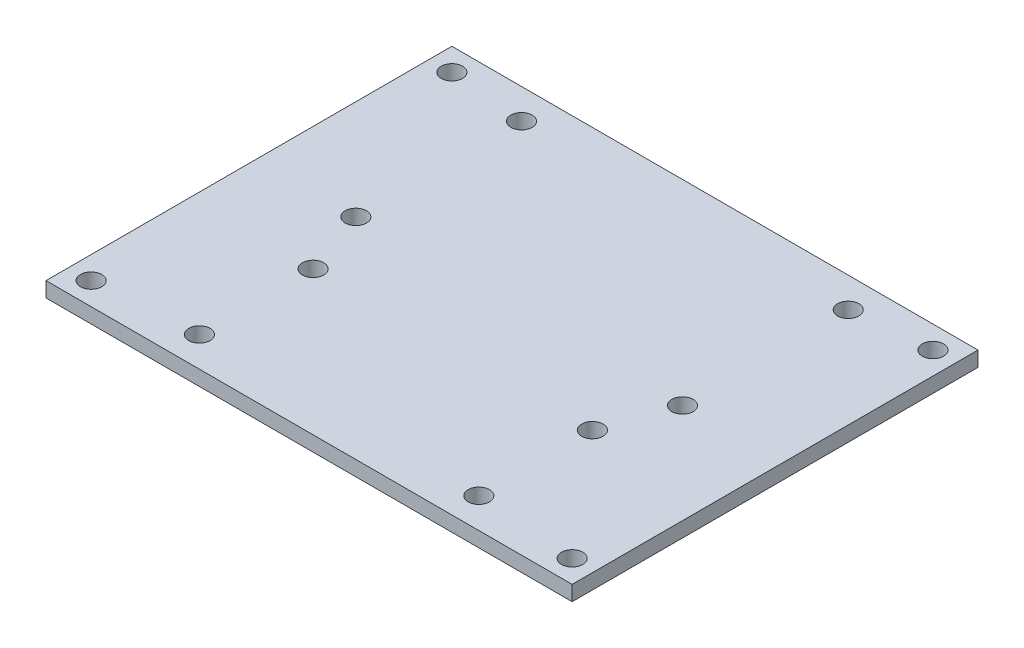
ISO-10303-21;
HEADER;
FILE_DESCRIPTION(('STEP AP214'),'2;1');
FILE_NAME('part.step','',(''),(''),'','','');
FILE_SCHEMA(('AUTOMOTIVE_DESIGN { 1 0 10303 214 1 1 1 1 }'));
ENDSEC;
DATA;
#1=APPLICATION_CONTEXT('core data for automotive mechanical design processes');
#2=APPLICATION_PROTOCOL_DEFINITION('international standard','automotive_design',2000,#1);
#3=PRODUCT_CONTEXT('',#1,'mechanical');
#4=PRODUCT('Part','Part','',(#3));
#5=PRODUCT_RELATED_PRODUCT_CATEGORY('part','',(#4));
#6=PRODUCT_DEFINITION_FORMATION('','',#4);
#7=PRODUCT_DEFINITION_CONTEXT('part definition',#1,'design');
#8=PRODUCT_DEFINITION('design','',#6,#7);
#9=PRODUCT_DEFINITION_SHAPE('','',#8);
#10=(LENGTH_UNIT() NAMED_UNIT(*) SI_UNIT(.MILLI.,.METRE.));
#11=(NAMED_UNIT(*) PLANE_ANGLE_UNIT() SI_UNIT($,.RADIAN.));
#12=(NAMED_UNIT(*) SI_UNIT($,.STERADIAN.) SOLID_ANGLE_UNIT());
#13=UNCERTAINTY_MEASURE_WITH_UNIT(LENGTH_MEASURE(1.E-05),#10,'distance_accuracy_value','');
#14=(GEOMETRIC_REPRESENTATION_CONTEXT(3) GLOBAL_UNCERTAINTY_ASSIGNED_CONTEXT((#13)) GLOBAL_UNIT_ASSIGNED_CONTEXT((#10,
#11,#12)) REPRESENTATION_CONTEXT('',''));
#15=CARTESIAN_POINT('',(0.,0.,0.));
#16=DIRECTION('',(0.,0.,1.));
#17=DIRECTION('',(1.,0.,0.));
#18=AXIS2_PLACEMENT_3D('',#15,#16,#17);
#19=CARTESIAN_POINT('',(0.,0.,0.));
#20=DIRECTION('',(0.,-1.,0.));
#21=DIRECTION('',(0.,0.,-1.));
#22=AXIS2_PLACEMENT_3D('',#19,#20,#21);
#23=PLANE('',#22);
#24=DIRECTION('',(0.,0.,1.));
#25=VECTOR('',#24,1.);
#26=CARTESIAN_POINT('',(-55.5625,0.,42.8625));
#27=LINE('',#26,#25);
#28=CARTESIAN_POINT('',(-55.5625,0.,-42.8625));
#29=VERTEX_POINT('',#28);
#30=CARTESIAN_POINT('',(-55.5625,0.,42.8625));
#31=VERTEX_POINT('',#30);
#32=EDGE_CURVE('E101',#29,#31,#27,.T.);
#33=ORIENTED_EDGE('',*,*,#32,.F.);
#34=DIRECTION('',(-1.,0.,0.));
#35=VECTOR('',#34,1.);
#36=CARTESIAN_POINT('',(-55.5625,0.,-42.8625));
#37=LINE('',#36,#35);
#38=CARTESIAN_POINT('',(55.5625,0.,-42.8625));
#39=VERTEX_POINT('',#38);
#40=EDGE_CURVE('E77',#39,#29,#37,.T.);
#41=ORIENTED_EDGE('',*,*,#40,.F.);
#42=DIRECTION('',(0.,0.,-1.));
#43=VECTOR('',#42,1.);
#44=CARTESIAN_POINT('',(55.5625,0.,42.8625));
#45=LINE('',#44,#43);
#46=CARTESIAN_POINT('',(55.5625,0.,42.8625));
#47=VERTEX_POINT('',#46);
#48=EDGE_CURVE('E71',#47,#39,#45,.T.);
#49=ORIENTED_EDGE('',*,*,#48,.F.);
#50=DIRECTION('',(1.,0.,0.));
#51=VECTOR('',#50,1.);
#52=CARTESIAN_POINT('',(-55.5625,0.,42.8625));
#53=LINE('',#52,#51);
#54=EDGE_CURVE('E93',#31,#47,#53,.T.);
#55=ORIENTED_EDGE('',*,*,#54,.F.);
#56=EDGE_LOOP('',(#33,#41,#49,#55));
#57=FACE_BOUND('',#56,.T.);
#58=CARTESIAN_POINT('',(50.8,0.,-38.1));
#59=DIRECTION('',(0.,-1.,0.));
#60=DIRECTION('',(0.,0.,-1.));
#61=AXIS2_PLACEMENT_3D('',#58,#59,#60);
#62=CIRCLE('',#61,2.25);
#63=CARTESIAN_POINT('',(50.8,0.,-40.35));
#64=VERTEX_POINT('',#63);
#65=EDGE_CURVE('E117',#64,#64,#62,.T.);
#66=ORIENTED_EDGE('',*,*,#65,.F.);
#67=EDGE_LOOP('',(#66));
#68=FACE_BOUND('',#67,.T.);
#69=CARTESIAN_POINT('',(-50.8,0.,-38.1));
#70=DIRECTION('',(0.,-1.,0.));
#71=DIRECTION('',(0.,0.,-1.));
#72=AXIS2_PLACEMENT_3D('',#69,#70,#71);
#73=CIRCLE('',#72,2.25);
#74=CARTESIAN_POINT('',(-50.8,0.,-40.35));
#75=VERTEX_POINT('',#74);
#76=EDGE_CURVE('E123',#75,#75,#73,.T.);
#77=ORIENTED_EDGE('',*,*,#76,.F.);
#78=EDGE_LOOP('',(#77));
#79=FACE_BOUND('',#78,.T.);
#80=CARTESIAN_POINT('',(50.8,0.,38.1));
#81=DIRECTION('',(0.,-1.,0.));
#82=DIRECTION('',(0.,0.,-1.));
#83=AXIS2_PLACEMENT_3D('',#80,#81,#82);
#84=CIRCLE('',#83,2.25);
#85=CARTESIAN_POINT('',(50.8,0.,35.85));
#86=VERTEX_POINT('',#85);
#87=EDGE_CURVE('E129',#86,#86,#84,.T.);
#88=ORIENTED_EDGE('',*,*,#87,.F.);
#89=EDGE_LOOP('',(#88));
#90=FACE_BOUND('',#89,.T.);
#91=CARTESIAN_POINT('',(-50.8,0.,38.1));
#92=DIRECTION('',(0.,-1.,0.));
#93=DIRECTION('',(0.,0.,-1.));
#94=AXIS2_PLACEMENT_3D('',#91,#92,#93);
#95=CIRCLE('',#94,2.25);
#96=CARTESIAN_POINT('',(-50.8,0.,35.85));
#97=VERTEX_POINT('',#96);
#98=EDGE_CURVE('E135',#97,#97,#95,.T.);
#99=ORIENTED_EDGE('',*,*,#98,.F.);
#100=EDGE_LOOP('',(#99));
#101=FACE_BOUND('',#100,.T.);
#102=CARTESIAN_POINT('',(-34.5,0.,-1.51249999999999));
#103=DIRECTION('',(0.,1.,0.));
#104=DIRECTION('',(0.,0.,1.));
#105=AXIS2_PLACEMENT_3D('',#102,#103,#104);
#106=CIRCLE('',#105,2.25);
#107=CARTESIAN_POINT('',(-34.5,0.,0.737500000000009));
#108=VERTEX_POINT('',#107);
#109=EDGE_CURVE('E138',#108,#108,#106,.T.);
#110=ORIENTED_EDGE('',*,*,#109,.T.);
#111=EDGE_LOOP('',(#110));
#112=FACE_BOUND('',#111,.T.);
#113=CARTESIAN_POINT('',(-34.5,0.,-36.5125));
#114=DIRECTION('',(0.,1.,0.));
#115=DIRECTION('',(0.,0.,1.));
#116=AXIS2_PLACEMENT_3D('',#113,#114,#115);
#117=CIRCLE('',#116,2.25);
#118=CARTESIAN_POINT('',(-34.5,0.,-34.2625));
#119=VERTEX_POINT('',#118);
#120=EDGE_CURVE('E144',#119,#119,#117,.T.);
#121=ORIENTED_EDGE('',*,*,#120,.T.);
#122=EDGE_LOOP('',(#121));
#123=FACE_BOUND('',#122,.T.);
#124=CARTESIAN_POINT('',(34.5,0.,-36.5125));
#125=DIRECTION('',(0.,1.,0.));
#126=DIRECTION('',(0.,0.,1.));
#127=AXIS2_PLACEMENT_3D('',#124,#125,#126);
#128=CIRCLE('',#127,2.25);
#129=CARTESIAN_POINT('',(34.5,0.,-34.2625));
#130=VERTEX_POINT('',#129);
#131=EDGE_CURVE('E150',#130,#130,#128,.T.);
#132=ORIENTED_EDGE('',*,*,#131,.T.);
#133=EDGE_LOOP('',(#132));
#134=FACE_BOUND('',#133,.T.);
#135=CARTESIAN_POINT('',(34.5,0.,-1.51249999999999));
#136=DIRECTION('',(0.,1.,0.));
#137=DIRECTION('',(0.,0.,1.));
#138=AXIS2_PLACEMENT_3D('',#135,#136,#137);
#139=CIRCLE('',#138,2.25);
#140=CARTESIAN_POINT('',(34.5,0.,0.737500000000009));
#141=VERTEX_POINT('',#140);
#142=EDGE_CURVE('E156',#141,#141,#139,.T.);
#143=ORIENTED_EDGE('',*,*,#142,.T.);
#144=EDGE_LOOP('',(#143));
#145=FACE_BOUND('',#144,.T.);
#146=CARTESIAN_POINT('',(29.5,0.,36.5125));
#147=DIRECTION('',(0.,1.,0.));
#148=DIRECTION('',(0.,0.,1.));
#149=AXIS2_PLACEMENT_3D('',#146,#147,#148);
#150=CIRCLE('',#149,2.25);
#151=CARTESIAN_POINT('',(29.5,0.,38.7625));
#152=VERTEX_POINT('',#151);
#153=EDGE_CURVE('E162',#152,#152,#150,.T.);
#154=ORIENTED_EDGE('',*,*,#153,.T.);
#155=EDGE_LOOP('',(#154));
#156=FACE_BOUND('',#155,.T.);
#157=CARTESIAN_POINT('',(29.5,0.,12.5125));
#158=DIRECTION('',(0.,1.,0.));
#159=DIRECTION('',(0.,0.,1.));
#160=AXIS2_PLACEMENT_3D('',#157,#158,#159);
#161=CIRCLE('',#160,2.25);
#162=CARTESIAN_POINT('',(29.5,0.,14.7625));
#163=VERTEX_POINT('',#162);
#164=EDGE_CURVE('E168',#163,#163,#161,.T.);
#165=ORIENTED_EDGE('',*,*,#164,.T.);
#166=EDGE_LOOP('',(#165));
#167=FACE_BOUND('',#166,.T.);
#168=CARTESIAN_POINT('',(-29.5,0.,12.5125));
#169=DIRECTION('',(0.,1.,0.));
#170=DIRECTION('',(0.,0.,1.));
#171=AXIS2_PLACEMENT_3D('',#168,#169,#170);
#172=CIRCLE('',#171,2.25);
#173=CARTESIAN_POINT('',(-29.5,0.,14.7625));
#174=VERTEX_POINT('',#173);
#175=EDGE_CURVE('E174',#174,#174,#172,.T.);
#176=ORIENTED_EDGE('',*,*,#175,.T.);
#177=EDGE_LOOP('',(#176));
#178=FACE_BOUND('',#177,.T.);
#179=CARTESIAN_POINT('',(-29.5,0.,36.5125));
#180=DIRECTION('',(0.,1.,0.));
#181=DIRECTION('',(0.,0.,1.));
#182=AXIS2_PLACEMENT_3D('',#179,#180,#181);
#183=CIRCLE('',#182,2.25);
#184=CARTESIAN_POINT('',(-29.5,0.,38.7625));
#185=VERTEX_POINT('',#184);
#186=EDGE_CURVE('E180',#185,#185,#183,.T.);
#187=ORIENTED_EDGE('',*,*,#186,.T.);
#188=EDGE_LOOP('',(#187));
#189=FACE_BOUND('',#188,.T.);
#190=ADVANCED_FACE('F37',(#57,#68,#79,#90,#101,#112,#123,#134,#145,#156,#167,#178,#189),#23,.T.);
#191=CARTESIAN_POINT('',(-55.5625,3.175,42.8625));
#192=DIRECTION('',(1.,0.,0.));
#193=DIRECTION('',(0.,0.,-1.));
#194=AXIS2_PLACEMENT_3D('',#191,#192,#193);
#195=PLANE('',#194);
#196=ORIENTED_EDGE('',*,*,#32,.T.);
#197=DIRECTION('',(0.,-1.,0.));
#198=VECTOR('',#197,1.);
#199=CARTESIAN_POINT('',(-55.5625,3.175,42.8625));
#200=LINE('',#199,#198);
#201=CARTESIAN_POINT('',(-55.5625,3.175,42.8625));
#202=VERTEX_POINT('',#201);
#203=EDGE_CURVE('E11',#202,#31,#200,.T.);
#204=ORIENTED_EDGE('',*,*,#203,.F.);
#205=DIRECTION('',(0.,0.,1.));
#206=VECTOR('',#205,1.);
#207=CARTESIAN_POINT('',(-55.5625,3.175,42.8625));
#208=LINE('',#207,#206);
#209=CARTESIAN_POINT('',(-55.5625,3.175,-42.8625));
#210=VERTEX_POINT('',#209);
#211=EDGE_CURVE('E89',#210,#202,#208,.T.);
#212=ORIENTED_EDGE('',*,*,#211,.F.);
#213=DIRECTION('',(0.,-1.,0.));
#214=VECTOR('',#213,1.);
#215=CARTESIAN_POINT('',(-55.5625,3.175,-42.8625));
#216=LINE('',#215,#214);
#217=EDGE_CURVE('E97',#210,#29,#216,.T.);
#218=ORIENTED_EDGE('',*,*,#217,.T.);
#219=EDGE_LOOP('',(#196,#204,#212,#218));
#220=FACE_BOUND('',#219,.T.);
#221=ADVANCED_FACE('F39',(#220),#195,.F.);
#222=CARTESIAN_POINT('',(-55.5625,3.175,42.8625));
#223=DIRECTION('',(0.,0.,-1.));
#224=DIRECTION('',(-1.,0.,0.));
#225=AXIS2_PLACEMENT_3D('',#222,#223,#224);
#226=PLANE('',#225);
#227=ORIENTED_EDGE('',*,*,#54,.T.);
#228=DIRECTION('',(0.,-1.,0.));
#229=VECTOR('',#228,1.);
#230=CARTESIAN_POINT('',(55.5625,3.175,42.8625));
#231=LINE('',#230,#229);
#232=CARTESIAN_POINT('',(55.5625,3.175,42.8625));
#233=VERTEX_POINT('',#232);
#234=EDGE_CURVE('E46',#233,#47,#231,.T.);
#235=ORIENTED_EDGE('',*,*,#234,.F.);
#236=DIRECTION('',(1.,0.,0.));
#237=VECTOR('',#236,1.);
#238=CARTESIAN_POINT('',(-55.5625,3.175,42.8625));
#239=LINE('',#238,#237);
#240=EDGE_CURVE('E84',#202,#233,#239,.T.);
#241=ORIENTED_EDGE('',*,*,#240,.F.);
#242=ORIENTED_EDGE('',*,*,#203,.T.);
#243=EDGE_LOOP('',(#227,#235,#241,#242));
#244=FACE_BOUND('',#243,.T.);
#245=ADVANCED_FACE('F92',(#244),#226,.F.);
#246=CARTESIAN_POINT('',(55.5625,3.175,42.8625));
#247=DIRECTION('',(-1.,0.,0.));
#248=DIRECTION('',(0.,0.,1.));
#249=AXIS2_PLACEMENT_3D('',#246,#247,#248);
#250=PLANE('',#249);
#251=ORIENTED_EDGE('',*,*,#48,.T.);
#252=DIRECTION('',(0.,-1.,0.));
#253=VECTOR('',#252,1.);
#254=CARTESIAN_POINT('',(55.5625,3.175,-42.8625));
#255=LINE('',#254,#253);
#256=CARTESIAN_POINT('',(55.5625,3.175,-42.8625));
#257=VERTEX_POINT('',#256);
#258=EDGE_CURVE('E94',#257,#39,#255,.T.);
#259=ORIENTED_EDGE('',*,*,#258,.F.);
#260=DIRECTION('',(0.,0.,-1.));
#261=VECTOR('',#260,1.);
#262=CARTESIAN_POINT('',(55.5625,3.175,42.8625));
#263=LINE('',#262,#261);
#264=EDGE_CURVE('E87',#233,#257,#263,.T.);
#265=ORIENTED_EDGE('',*,*,#264,.F.);
#266=ORIENTED_EDGE('',*,*,#234,.T.);
#267=EDGE_LOOP('',(#251,#259,#265,#266));
#268=FACE_BOUND('',#267,.T.);
#269=ADVANCED_FACE('F95',(#268),#250,.F.);
#270=CARTESIAN_POINT('',(-55.5625,3.175,-42.8625));
#271=DIRECTION('',(0.,0.,1.));
#272=DIRECTION('',(1.,0.,0.));
#273=AXIS2_PLACEMENT_3D('',#270,#271,#272);
#274=PLANE('',#273);
#275=ORIENTED_EDGE('',*,*,#40,.T.);
#276=ORIENTED_EDGE('',*,*,#217,.F.);
#277=DIRECTION('',(-1.,0.,0.));
#278=VECTOR('',#277,1.);
#279=CARTESIAN_POINT('',(-55.5625,3.175,-42.8625));
#280=LINE('',#279,#278);
#281=EDGE_CURVE('E54',#257,#210,#280,.T.);
#282=ORIENTED_EDGE('',*,*,#281,.F.);
#283=ORIENTED_EDGE('',*,*,#258,.T.);
#284=EDGE_LOOP('',(#275,#276,#282,#283));
#285=FACE_BOUND('',#284,.T.);
#286=ADVANCED_FACE('F109',(#285),#274,.F.);
#287=CARTESIAN_POINT('',(0.,3.175,0.));
#288=DIRECTION('',(0.,-1.,0.));
#289=DIRECTION('',(0.,0.,-1.));
#290=AXIS2_PLACEMENT_3D('',#287,#288,#289);
#291=PLANE('',#290);
#292=CARTESIAN_POINT('',(-29.5,3.175,36.5125));
#293=DIRECTION('',(0.,1.,0.));
#294=DIRECTION('',(0.,0.,1.));
#295=AXIS2_PLACEMENT_3D('',#292,#293,#294);
#296=CIRCLE('',#295,2.25);
#297=CARTESIAN_POINT('',(-29.5,3.175,38.7625));
#298=VERTEX_POINT('',#297);
#299=EDGE_CURVE('E183',#298,#298,#296,.T.);
#300=ORIENTED_EDGE('',*,*,#299,.F.);
#301=EDGE_LOOP('',(#300));
#302=FACE_BOUND('',#301,.T.);
#303=CARTESIAN_POINT('',(-29.5,3.175,12.5125));
#304=DIRECTION('',(0.,1.,0.));
#305=DIRECTION('',(0.,0.,1.));
#306=AXIS2_PLACEMENT_3D('',#303,#304,#305);
#307=CIRCLE('',#306,2.25);
#308=CARTESIAN_POINT('',(-29.5,3.175,14.7625));
#309=VERTEX_POINT('',#308);
#310=EDGE_CURVE('E177',#309,#309,#307,.T.);
#311=ORIENTED_EDGE('',*,*,#310,.F.);
#312=EDGE_LOOP('',(#311));
#313=FACE_BOUND('',#312,.T.);
#314=CARTESIAN_POINT('',(29.5,3.175,12.5125));
#315=DIRECTION('',(0.,1.,0.));
#316=DIRECTION('',(0.,0.,1.));
#317=AXIS2_PLACEMENT_3D('',#314,#315,#316);
#318=CIRCLE('',#317,2.25);
#319=CARTESIAN_POINT('',(29.5,3.175,14.7625));
#320=VERTEX_POINT('',#319);
#321=EDGE_CURVE('E171',#320,#320,#318,.T.);
#322=ORIENTED_EDGE('',*,*,#321,.F.);
#323=EDGE_LOOP('',(#322));
#324=FACE_BOUND('',#323,.T.);
#325=CARTESIAN_POINT('',(29.5,3.175,36.5125));
#326=DIRECTION('',(0.,1.,0.));
#327=DIRECTION('',(0.,0.,1.));
#328=AXIS2_PLACEMENT_3D('',#325,#326,#327);
#329=CIRCLE('',#328,2.25);
#330=CARTESIAN_POINT('',(29.5,3.175,38.7625));
#331=VERTEX_POINT('',#330);
#332=EDGE_CURVE('E165',#331,#331,#329,.T.);
#333=ORIENTED_EDGE('',*,*,#332,.F.);
#334=EDGE_LOOP('',(#333));
#335=FACE_BOUND('',#334,.T.);
#336=CARTESIAN_POINT('',(34.5,3.175,-1.51249999999999));
#337=DIRECTION('',(0.,1.,0.));
#338=DIRECTION('',(0.,0.,1.));
#339=AXIS2_PLACEMENT_3D('',#336,#337,#338);
#340=CIRCLE('',#339,2.25);
#341=CARTESIAN_POINT('',(34.5,3.175,0.737500000000009));
#342=VERTEX_POINT('',#341);
#343=EDGE_CURVE('E159',#342,#342,#340,.T.);
#344=ORIENTED_EDGE('',*,*,#343,.F.);
#345=EDGE_LOOP('',(#344));
#346=FACE_BOUND('',#345,.T.);
#347=CARTESIAN_POINT('',(34.5,3.175,-36.5125));
#348=DIRECTION('',(0.,1.,0.));
#349=DIRECTION('',(0.,0.,1.));
#350=AXIS2_PLACEMENT_3D('',#347,#348,#349);
#351=CIRCLE('',#350,2.25);
#352=CARTESIAN_POINT('',(34.5,3.175,-34.2625));
#353=VERTEX_POINT('',#352);
#354=EDGE_CURVE('E153',#353,#353,#351,.T.);
#355=ORIENTED_EDGE('',*,*,#354,.F.);
#356=EDGE_LOOP('',(#355));
#357=FACE_BOUND('',#356,.T.);
#358=CARTESIAN_POINT('',(-34.5,3.175,-36.5125));
#359=DIRECTION('',(0.,1.,0.));
#360=DIRECTION('',(0.,0.,1.));
#361=AXIS2_PLACEMENT_3D('',#358,#359,#360);
#362=CIRCLE('',#361,2.25);
#363=CARTESIAN_POINT('',(-34.5,3.175,-34.2625));
#364=VERTEX_POINT('',#363);
#365=EDGE_CURVE('E147',#364,#364,#362,.T.);
#366=ORIENTED_EDGE('',*,*,#365,.F.);
#367=EDGE_LOOP('',(#366));
#368=FACE_BOUND('',#367,.T.);
#369=CARTESIAN_POINT('',(-34.5,3.175,-1.51249999999999));
#370=DIRECTION('',(0.,1.,0.));
#371=DIRECTION('',(0.,0.,1.));
#372=AXIS2_PLACEMENT_3D('',#369,#370,#371);
#373=CIRCLE('',#372,2.25);
#374=CARTESIAN_POINT('',(-34.5,3.175,0.737500000000009));
#375=VERTEX_POINT('',#374);
#376=EDGE_CURVE('E141',#375,#375,#373,.T.);
#377=ORIENTED_EDGE('',*,*,#376,.F.);
#378=EDGE_LOOP('',(#377));
#379=FACE_BOUND('',#378,.T.);
#380=CARTESIAN_POINT('',(-50.8,3.175,38.1));
#381=DIRECTION('',(0.,-1.,0.));
#382=DIRECTION('',(0.,0.,-1.));
#383=AXIS2_PLACEMENT_3D('',#380,#381,#382);
#384=CIRCLE('',#383,2.25);
#385=CARTESIAN_POINT('',(-50.8,3.175,35.85));
#386=VERTEX_POINT('',#385);
#387=EDGE_CURVE('E132',#386,#386,#384,.T.);
#388=ORIENTED_EDGE('',*,*,#387,.T.);
#389=EDGE_LOOP('',(#388));
#390=FACE_BOUND('',#389,.T.);
#391=CARTESIAN_POINT('',(50.8,3.175,38.1));
#392=DIRECTION('',(0.,-1.,0.));
#393=DIRECTION('',(0.,0.,-1.));
#394=AXIS2_PLACEMENT_3D('',#391,#392,#393);
#395=CIRCLE('',#394,2.25);
#396=CARTESIAN_POINT('',(50.8,3.175,35.85));
#397=VERTEX_POINT('',#396);
#398=EDGE_CURVE('E126',#397,#397,#395,.T.);
#399=ORIENTED_EDGE('',*,*,#398,.T.);
#400=EDGE_LOOP('',(#399));
#401=FACE_BOUND('',#400,.T.);
#402=CARTESIAN_POINT('',(-50.8,3.175,-38.1));
#403=DIRECTION('',(0.,-1.,0.));
#404=DIRECTION('',(0.,0.,-1.));
#405=AXIS2_PLACEMENT_3D('',#402,#403,#404);
#406=CIRCLE('',#405,2.25);
#407=CARTESIAN_POINT('',(-50.8,3.175,-40.35));
#408=VERTEX_POINT('',#407);
#409=EDGE_CURVE('E120',#408,#408,#406,.T.);
#410=ORIENTED_EDGE('',*,*,#409,.T.);
#411=EDGE_LOOP('',(#410));
#412=FACE_BOUND('',#411,.T.);
#413=CARTESIAN_POINT('',(50.8,3.175,-38.1));
#414=DIRECTION('',(0.,-1.,0.));
#415=DIRECTION('',(0.,0.,-1.));
#416=AXIS2_PLACEMENT_3D('',#413,#414,#415);
#417=CIRCLE('',#416,2.25);
#418=CARTESIAN_POINT('',(50.8,3.175,-40.35));
#419=VERTEX_POINT('',#418);
#420=EDGE_CURVE('E104',#419,#419,#417,.T.);
#421=ORIENTED_EDGE('',*,*,#420,.T.);
#422=EDGE_LOOP('',(#421));
#423=FACE_BOUND('',#422,.T.);
#424=ORIENTED_EDGE('',*,*,#211,.T.);
#425=ORIENTED_EDGE('',*,*,#240,.T.);
#426=ORIENTED_EDGE('',*,*,#264,.T.);
#427=ORIENTED_EDGE('',*,*,#281,.T.);
#428=EDGE_LOOP('',(#424,#425,#426,#427));
#429=FACE_BOUND('',#428,.T.);
#430=ADVANCED_FACE('F85',(#302,#313,#324,#335,#346,#357,#368,#379,#390,#401,#412,#423,#429),
#291,.F.);
#431=CARTESIAN_POINT('',(50.8,0.,-38.1));
#432=DIRECTION('',(0.,-1.,0.));
#433=DIRECTION('',(0.,0.,-1.));
#434=AXIS2_PLACEMENT_3D('',#431,#432,#433);
#435=CYLINDRICAL_SURFACE('',#434,2.25);
#436=ORIENTED_EDGE('',*,*,#420,.F.);
#437=EDGE_LOOP('',(#436));
#438=FACE_BOUND('',#437,.T.);
#439=ORIENTED_EDGE('',*,*,#65,.T.);
#440=EDGE_LOOP('',(#439));
#441=FACE_BOUND('',#440,.T.);
#442=ADVANCED_FACE('F191',(#438,#441),#435,.F.);
#443=CARTESIAN_POINT('',(-50.8,0.,-38.1));
#444=DIRECTION('',(0.,-1.,0.));
#445=DIRECTION('',(0.,0.,-1.));
#446=AXIS2_PLACEMENT_3D('',#443,#444,#445);
#447=CYLINDRICAL_SURFACE('',#446,2.25);
#448=ORIENTED_EDGE('',*,*,#409,.F.);
#449=EDGE_LOOP('',(#448));
#450=FACE_BOUND('',#449,.T.);
#451=ORIENTED_EDGE('',*,*,#76,.T.);
#452=EDGE_LOOP('',(#451));
#453=FACE_BOUND('',#452,.T.);
#454=ADVANCED_FACE('F217',(#450,#453),#447,.F.);
#455=CARTESIAN_POINT('',(50.8,0.,38.1));
#456=DIRECTION('',(0.,-1.,0.));
#457=DIRECTION('',(0.,0.,-1.));
#458=AXIS2_PLACEMENT_3D('',#455,#456,#457);
#459=CYLINDRICAL_SURFACE('',#458,2.25);
#460=ORIENTED_EDGE('',*,*,#398,.F.);
#461=EDGE_LOOP('',(#460));
#462=FACE_BOUND('',#461,.T.);
#463=ORIENTED_EDGE('',*,*,#87,.T.);
#464=EDGE_LOOP('',(#463));
#465=FACE_BOUND('',#464,.T.);
#466=ADVANCED_FACE('F281',(#462,#465),#459,.F.);
#467=CARTESIAN_POINT('',(-50.8,0.,38.1));
#468=DIRECTION('',(0.,-1.,0.));
#469=DIRECTION('',(0.,0.,-1.));
#470=AXIS2_PLACEMENT_3D('',#467,#468,#469);
#471=CYLINDRICAL_SURFACE('',#470,2.25);
#472=ORIENTED_EDGE('',*,*,#387,.F.);
#473=EDGE_LOOP('',(#472));
#474=FACE_BOUND('',#473,.T.);
#475=ORIENTED_EDGE('',*,*,#98,.T.);
#476=EDGE_LOOP('',(#475));
#477=FACE_BOUND('',#476,.T.);
#478=ADVANCED_FACE('F277',(#474,#477),#471,.F.);
#479=CARTESIAN_POINT('',(-34.5,3.175,-1.51249999999999));
#480=DIRECTION('',(0.,1.,0.));
#481=DIRECTION('',(0.,0.,1.));
#482=AXIS2_PLACEMENT_3D('',#479,#480,#481);
#483=CYLINDRICAL_SURFACE('',#482,2.25);
#484=ORIENTED_EDGE('',*,*,#109,.F.);
#485=EDGE_LOOP('',(#484));
#486=FACE_BOUND('',#485,.T.);
#487=ORIENTED_EDGE('',*,*,#376,.T.);
#488=EDGE_LOOP('',(#487));
#489=FACE_BOUND('',#488,.T.);
#490=ADVANCED_FACE('F273',(#486,#489),#483,.F.);
#491=CARTESIAN_POINT('',(-34.5,3.175,-36.5125));
#492=DIRECTION('',(0.,1.,0.));
#493=DIRECTION('',(0.,0.,1.));
#494=AXIS2_PLACEMENT_3D('',#491,#492,#493);
#495=CYLINDRICAL_SURFACE('',#494,2.25);
#496=ORIENTED_EDGE('',*,*,#120,.F.);
#497=EDGE_LOOP('',(#496));
#498=FACE_BOUND('',#497,.T.);
#499=ORIENTED_EDGE('',*,*,#365,.T.);
#500=EDGE_LOOP('',(#499));
#501=FACE_BOUND('',#500,.T.);
#502=ADVANCED_FACE('F269',(#498,#501),#495,.F.);
#503=CARTESIAN_POINT('',(34.5,3.175,-36.5125));
#504=DIRECTION('',(0.,1.,0.));
#505=DIRECTION('',(0.,0.,1.));
#506=AXIS2_PLACEMENT_3D('',#503,#504,#505);
#507=CYLINDRICAL_SURFACE('',#506,2.25);
#508=ORIENTED_EDGE('',*,*,#131,.F.);
#509=EDGE_LOOP('',(#508));
#510=FACE_BOUND('',#509,.T.);
#511=ORIENTED_EDGE('',*,*,#354,.T.);
#512=EDGE_LOOP('',(#511));
#513=FACE_BOUND('',#512,.T.);
#514=ADVANCED_FACE('F265',(#510,#513),#507,.F.);
#515=CARTESIAN_POINT('',(34.5,3.175,-1.51249999999999));
#516=DIRECTION('',(0.,1.,0.));
#517=DIRECTION('',(0.,0.,1.));
#518=AXIS2_PLACEMENT_3D('',#515,#516,#517);
#519=CYLINDRICAL_SURFACE('',#518,2.25);
#520=ORIENTED_EDGE('',*,*,#142,.F.);
#521=EDGE_LOOP('',(#520));
#522=FACE_BOUND('',#521,.T.);
#523=ORIENTED_EDGE('',*,*,#343,.T.);
#524=EDGE_LOOP('',(#523));
#525=FACE_BOUND('',#524,.T.);
#526=ADVANCED_FACE('F261',(#522,#525),#519,.F.);
#527=CARTESIAN_POINT('',(29.5,3.175,36.5125));
#528=DIRECTION('',(0.,1.,0.));
#529=DIRECTION('',(0.,0.,1.));
#530=AXIS2_PLACEMENT_3D('',#527,#528,#529);
#531=CYLINDRICAL_SURFACE('',#530,2.25);
#532=ORIENTED_EDGE('',*,*,#153,.F.);
#533=EDGE_LOOP('',(#532));
#534=FACE_BOUND('',#533,.T.);
#535=ORIENTED_EDGE('',*,*,#332,.T.);
#536=EDGE_LOOP('',(#535));
#537=FACE_BOUND('',#536,.T.);
#538=ADVANCED_FACE('F257',(#534,#537),#531,.F.);
#539=CARTESIAN_POINT('',(29.5,3.175,12.5125));
#540=DIRECTION('',(0.,1.,0.));
#541=DIRECTION('',(0.,0.,1.));
#542=AXIS2_PLACEMENT_3D('',#539,#540,#541);
#543=CYLINDRICAL_SURFACE('',#542,2.25);
#544=ORIENTED_EDGE('',*,*,#164,.F.);
#545=EDGE_LOOP('',(#544));
#546=FACE_BOUND('',#545,.T.);
#547=ORIENTED_EDGE('',*,*,#321,.T.);
#548=EDGE_LOOP('',(#547));
#549=FACE_BOUND('',#548,.T.);
#550=ADVANCED_FACE('F251',(#546,#549),#543,.F.);
#551=CARTESIAN_POINT('',(-29.5,3.175,12.5125));
#552=DIRECTION('',(0.,1.,0.));
#553=DIRECTION('',(0.,0.,1.));
#554=AXIS2_PLACEMENT_3D('',#551,#552,#553);
#555=CYLINDRICAL_SURFACE('',#554,2.25);
#556=ORIENTED_EDGE('',*,*,#175,.F.);
#557=EDGE_LOOP('',(#556));
#558=FACE_BOUND('',#557,.T.);
#559=ORIENTED_EDGE('',*,*,#310,.T.);
#560=EDGE_LOOP('',(#559));
#561=FACE_BOUND('',#560,.T.);
#562=ADVANCED_FACE('F246',(#558,#561),#555,.F.);
#563=CARTESIAN_POINT('',(-29.5,3.175,36.5125));
#564=DIRECTION('',(0.,1.,0.));
#565=DIRECTION('',(0.,0.,1.));
#566=AXIS2_PLACEMENT_3D('',#563,#564,#565);
#567=CYLINDRICAL_SURFACE('',#566,2.25);
#568=ORIENTED_EDGE('',*,*,#186,.F.);
#569=EDGE_LOOP('',(#568));
#570=FACE_BOUND('',#569,.T.);
#571=ORIENTED_EDGE('',*,*,#299,.T.);
#572=EDGE_LOOP('',(#571));
#573=FACE_BOUND('',#572,.T.);
#574=ADVANCED_FACE('F187',(#570,#573),#567,.F.);
#575=CLOSED_SHELL('',(#190,#221,#245,#269,#286,#430,#442,#454,#466,#478,#490,#502,#514,#526,
#538,#550,#562,#574));
#576=MANIFOLD_SOLID_BREP('B2',#575);
#577=ADVANCED_BREP_SHAPE_REPRESENTATION('',(#18,#576),#14);
#578=SHAPE_DEFINITION_REPRESENTATION(#9,#577);
ENDSEC;
END-ISO-10303-21;
